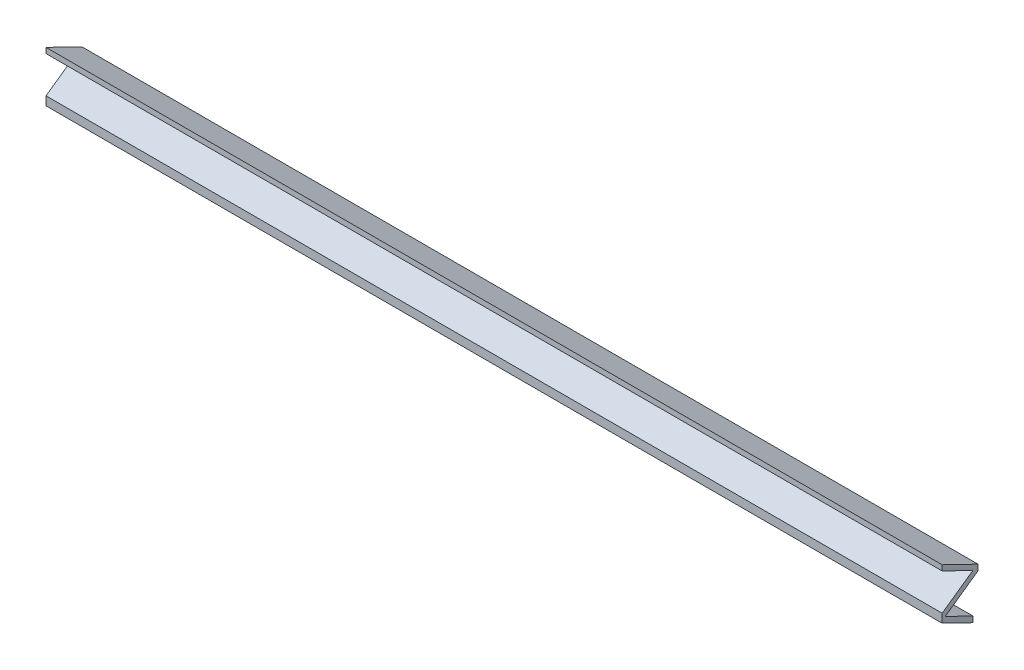
ISO-10303-21;
HEADER;
FILE_DESCRIPTION(('STEP AP214'),'2;1');
FILE_NAME('part.step','',(''),(''),'','','');
FILE_SCHEMA(('AUTOMOTIVE_DESIGN { 1 0 10303 214 1 1 1 1 }'));
ENDSEC;
DATA;
#1=APPLICATION_CONTEXT('core data for automotive mechanical design processes');
#2=APPLICATION_PROTOCOL_DEFINITION('international standard','automotive_design',2000,#1);
#3=PRODUCT_CONTEXT('',#1,'mechanical');
#4=PRODUCT('Part','Part','',(#3));
#5=PRODUCT_RELATED_PRODUCT_CATEGORY('part','',(#4));
#6=PRODUCT_DEFINITION_FORMATION('','',#4);
#7=PRODUCT_DEFINITION_CONTEXT('part definition',#1,'design');
#8=PRODUCT_DEFINITION('design','',#6,#7);
#9=PRODUCT_DEFINITION_SHAPE('','',#8);
#10=(LENGTH_UNIT() NAMED_UNIT(*) SI_UNIT(.MILLI.,.METRE.));
#11=(NAMED_UNIT(*) PLANE_ANGLE_UNIT() SI_UNIT($,.RADIAN.));
#12=(NAMED_UNIT(*) SI_UNIT($,.STERADIAN.) SOLID_ANGLE_UNIT());
#13=UNCERTAINTY_MEASURE_WITH_UNIT(LENGTH_MEASURE(1.E-05),#10,'distance_accuracy_value','');
#14=(GEOMETRIC_REPRESENTATION_CONTEXT(3) GLOBAL_UNCERTAINTY_ASSIGNED_CONTEXT((#13)) GLOBAL_UNIT_ASSIGNED_CONTEXT((#10,
#11,#12)) REPRESENTATION_CONTEXT('',''));
#15=CARTESIAN_POINT('',(0.,0.,0.));
#16=DIRECTION('',(0.,0.,1.));
#17=DIRECTION('',(1.,0.,0.));
#18=AXIS2_PLACEMENT_3D('',#15,#16,#17);
#19=CARTESIAN_POINT('',(500.,0.,0.));
#20=DIRECTION('',(0.,-0.899741930154531,0.436422340310163));
#21=DIRECTION('',(0.,-0.436422340310163,-0.899741930154531));
#22=AXIS2_PLACEMENT_3D('',#19,#20,#21);
#23=PLANE('',#22);
#24=DIRECTION('',(0.,0.436422340310163,0.899741930154531));
#25=VECTOR('',#24,1.);
#26=CARTESIAN_POINT('',(0.,0.,0.));
#27=LINE('',#26,#25);
#28=CARTESIAN_POINT('',(0.,-9.70105595134834,-20.));
#29=VERTEX_POINT('',#28);
#30=CARTESIAN_POINT('',(0.,0.,0.));
#31=VERTEX_POINT('',#30);
#32=EDGE_CURVE('E152',#29,#31,#27,.T.);
#33=ORIENTED_EDGE('',*,*,#32,.T.);
#34=DIRECTION('',(-1.,0.,0.));
#35=VECTOR('',#34,1.);
#36=CARTESIAN_POINT('',(500.,0.,0.));
#37=LINE('',#36,#35);
#38=CARTESIAN_POINT('',(500.,0.,0.));
#39=VERTEX_POINT('',#38);
#40=EDGE_CURVE('E11',#39,#31,#37,.T.);
#41=ORIENTED_EDGE('',*,*,#40,.F.);
#42=DIRECTION('',(0.,0.436422340310163,0.899741930154531));
#43=VECTOR('',#42,1.);
#44=CARTESIAN_POINT('',(500.,0.,0.));
#45=LINE('',#44,#43);
#46=CARTESIAN_POINT('',(500.,-9.70105595134834,-20.));
#47=VERTEX_POINT('',#46);
#48=EDGE_CURVE('E180',#47,#39,#45,.T.);
#49=ORIENTED_EDGE('',*,*,#48,.F.);
#50=DIRECTION('',(-1.,0.,0.));
#51=VECTOR('',#50,1.);
#52=CARTESIAN_POINT('',(500.,-9.70105595134834,-20.));
#53=LINE('',#52,#51);
#54=EDGE_CURVE('E148',#47,#29,#53,.T.);
#55=ORIENTED_EDGE('',*,*,#54,.T.);
#56=EDGE_LOOP('',(#33,#41,#49,#55));
#57=FACE_BOUND('',#56,.T.);
#58=ADVANCED_FACE('F39',(#57),#23,.F.);
#59=CARTESIAN_POINT('',(500.,0.,0.));
#60=DIRECTION('',(0.,0.,-1.));
#61=DIRECTION('',(0.,1.,0.));
#62=AXIS2_PLACEMENT_3D('',#59,#60,#61);
#63=PLANE('',#62);
#64=DIRECTION('',(0.,-1.,0.));
#65=VECTOR('',#64,1.);
#66=CARTESIAN_POINT('',(0.,0.,0.));
#67=LINE('',#66,#65);
#68=CARTESIAN_POINT('',(0.,-3.,0.));
#69=VERTEX_POINT('',#68);
#70=EDGE_CURVE('E156',#31,#69,#67,.T.);
#71=ORIENTED_EDGE('',*,*,#70,.T.);
#72=DIRECTION('',(-1.,0.,0.));
#73=VECTOR('',#72,1.);
#74=CARTESIAN_POINT('',(500.,-3.,0.));
#75=LINE('',#74,#73);
#76=CARTESIAN_POINT('',(500.,-3.,0.));
#77=VERTEX_POINT('',#76);
#78=EDGE_CURVE('E48',#77,#69,#75,.T.);
#79=ORIENTED_EDGE('',*,*,#78,.F.);
#80=DIRECTION('',(0.,-1.,0.));
#81=VECTOR('',#80,1.);
#82=CARTESIAN_POINT('',(500.,0.,0.));
#83=LINE('',#82,#81);
#84=EDGE_CURVE('E105',#39,#77,#83,.T.);
#85=ORIENTED_EDGE('',*,*,#84,.F.);
#86=ORIENTED_EDGE('',*,*,#40,.T.);
#87=EDGE_LOOP('',(#71,#79,#85,#86));
#88=FACE_BOUND('',#87,.T.);
#89=ADVANCED_FACE('F244',(#88),#63,.F.);
#90=CARTESIAN_POINT('',(500.,-3.,0.));
#91=DIRECTION('',(0.,0.899741930154531,-0.436422340310163));
#92=DIRECTION('',(0.,0.436422340310163,0.899741930154531));
#93=AXIS2_PLACEMENT_3D('',#90,#91,#92);
#94=PLANE('',#93);
#95=DIRECTION('',(0.,-0.436422340310163,-0.899741930154531));
#96=VECTOR('',#95,1.);
#97=CARTESIAN_POINT('',(0.,-3.,0.));
#98=LINE('',#97,#96);
#99=CARTESIAN_POINT('',(0.,-11.3187694157209,-17.1502348969851));
#100=VERTEX_POINT('',#99);
#101=EDGE_CURVE('E159',#69,#100,#98,.T.);
#102=ORIENTED_EDGE('',*,*,#101,.T.);
#103=DIRECTION('',(-1.,0.,0.));
#104=VECTOR('',#103,1.);
#105=CARTESIAN_POINT('',(500.,-11.3187694157209,-17.1502348969851));
#106=LINE('',#105,#104);
#107=CARTESIAN_POINT('',(500.,-11.3187694157209,-17.1502348969851));
#108=VERTEX_POINT('',#107);
#109=EDGE_CURVE('E199',#108,#100,#106,.T.);
#110=ORIENTED_EDGE('',*,*,#109,.F.);
#111=DIRECTION('',(0.,-0.436422340310163,-0.899741930154531));
#112=VECTOR('',#111,1.);
#113=CARTESIAN_POINT('',(500.,-3.,0.));
#114=LINE('',#113,#112);
#115=EDGE_CURVE('E209',#77,#108,#114,.T.);
#116=ORIENTED_EDGE('',*,*,#115,.F.);
#117=ORIENTED_EDGE('',*,*,#78,.T.);
#118=EDGE_LOOP('',(#102,#110,#116,#117));
#119=FACE_BOUND('',#118,.T.);
#120=ADVANCED_FACE('F207',(#119),#94,.F.);
#121=CARTESIAN_POINT('',(500.,-23.3976604087239,0.));
#122=DIRECTION('',(0.,-0.817577344114148,-0.575818796490056));
#123=DIRECTION('',(0.,0.575818796490056,-0.817577344114148));
#124=AXIS2_PLACEMENT_3D('',#121,#122,#123);
#125=PLANE('',#124);
#126=DIRECTION('',(0.,-0.575818796490056,0.817577344114148));
#127=VECTOR('',#126,1.);
#128=CARTESIAN_POINT('',(0.,-23.3976604087239,0.));
#129=LINE('',#128,#127);
#130=CARTESIAN_POINT('',(0.,-23.3976604087239,0.));
#131=VERTEX_POINT('',#130);
#132=EDGE_CURVE('E162',#100,#131,#129,.T.);
#133=ORIENTED_EDGE('',*,*,#132,.T.);
#134=DIRECTION('',(-1.,0.,0.));
#135=VECTOR('',#134,1.);
#136=CARTESIAN_POINT('',(500.,-23.3976604087239,0.));
#137=LINE('',#136,#135);
#138=CARTESIAN_POINT('',(500.,-23.3976604087239,0.));
#139=VERTEX_POINT('',#138);
#140=EDGE_CURVE('E195',#139,#131,#137,.T.);
#141=ORIENTED_EDGE('',*,*,#140,.F.);
#142=DIRECTION('',(0.,-0.575818796490056,0.817577344114148));
#143=VECTOR('',#142,1.);
#144=CARTESIAN_POINT('',(500.,-23.3976604087239,0.));
#145=LINE('',#144,#143);
#146=EDGE_CURVE('E228',#108,#139,#145,.T.);
#147=ORIENTED_EDGE('',*,*,#146,.F.);
#148=ORIENTED_EDGE('',*,*,#109,.T.);
#149=EDGE_LOOP('',(#133,#141,#147,#148));
#150=FACE_BOUND('',#149,.T.);
#151=ADVANCED_FACE('F218',(#150),#125,.F.);
#152=CARTESIAN_POINT('',(500.,-23.3976604087239,0.));
#153=DIRECTION('',(0.,0.,-1.));
#154=DIRECTION('',(-1.,0.,0.));
#155=AXIS2_PLACEMENT_3D('',#152,#153,#154);
#156=PLANE('',#155);
#157=DIRECTION('',(0.,-1.,0.));
#158=VECTOR('',#157,1.);
#159=CARTESIAN_POINT('',(0.,-23.3976604087239,0.));
#160=LINE('',#159,#158);
#161=CARTESIAN_POINT('',(0.,-28.2555464430726,0.));
#162=VERTEX_POINT('',#161);
#163=EDGE_CURVE('E165',#131,#162,#160,.T.);
#164=ORIENTED_EDGE('',*,*,#163,.T.);
#165=DIRECTION('',(-1.,0.,0.));
#166=VECTOR('',#165,1.);
#167=CARTESIAN_POINT('',(500.,-28.2555464430726,0.));
#168=LINE('',#167,#166);
#169=CARTESIAN_POINT('',(500.,-28.2555464430726,0.));
#170=VERTEX_POINT('',#169);
#171=EDGE_CURVE('E191',#170,#162,#168,.T.);
#172=ORIENTED_EDGE('',*,*,#171,.F.);
#173=DIRECTION('',(0.,-1.,0.));
#174=VECTOR('',#173,1.);
#175=CARTESIAN_POINT('',(500.,-23.3976604087239,0.));
#176=LINE('',#175,#174);
#177=EDGE_CURVE('E224',#139,#170,#176,.T.);
#178=ORIENTED_EDGE('',*,*,#177,.F.);
#179=ORIENTED_EDGE('',*,*,#140,.T.);
#180=EDGE_LOOP('',(#164,#172,#178,#179));
#181=FACE_BOUND('',#180,.T.);
#182=ADVANCED_FACE('F222',(#181),#156,.F.);
#183=CARTESIAN_POINT('',(500.,-36.5743158587936,-17.1502348969851));
#184=DIRECTION('',(0.,0.899741930154531,-0.436422340310163));
#185=DIRECTION('',(0.,0.436422340310163,0.899741930154531));
#186=AXIS2_PLACEMENT_3D('',#183,#184,#185);
#187=PLANE('',#186);
#188=DIRECTION('',(0.,-0.436422340310163,-0.899741930154531));
#189=VECTOR('',#188,1.);
#190=CARTESIAN_POINT('',(0.,-36.5743158587936,-17.1502348969851));
#191=LINE('',#190,#189);
#192=CARTESIAN_POINT('',(0.,-36.5743158587936,-17.1502348969851));
#193=VERTEX_POINT('',#192);
#194=EDGE_CURVE('E168',#162,#193,#191,.T.);
#195=ORIENTED_EDGE('',*,*,#194,.T.);
#196=DIRECTION('',(-1.,0.,0.));
#197=VECTOR('',#196,1.);
#198=CARTESIAN_POINT('',(500.,-36.5743158587936,-17.1502348969851));
#199=LINE('',#198,#197);
#200=CARTESIAN_POINT('',(500.,-36.5743158587936,-17.1502348969851));
#201=VERTEX_POINT('',#200);
#202=EDGE_CURVE('E187',#201,#193,#199,.T.);
#203=ORIENTED_EDGE('',*,*,#202,.F.);
#204=DIRECTION('',(0.,-0.436422340310163,-0.899741930154531));
#205=VECTOR('',#204,1.);
#206=CARTESIAN_POINT('',(500.,-36.5743158587936,-17.1502348969851));
#207=LINE('',#206,#205);
#208=EDGE_CURVE('E227',#170,#201,#207,.T.);
#209=ORIENTED_EDGE('',*,*,#208,.F.);
#210=ORIENTED_EDGE('',*,*,#171,.T.);
#211=EDGE_LOOP('',(#195,#203,#209,#210));
#212=FACE_BOUND('',#211,.T.);
#213=ADVANCED_FACE('F256',(#212),#187,.F.);
#214=CARTESIAN_POINT('',(500.,-33.3217825966434,-17.1502348969851));
#215=DIRECTION('',(0.,0.,1.));
#216=DIRECTION('',(1.,0.,0.));
#217=AXIS2_PLACEMENT_3D('',#214,#215,#216);
#218=PLANE('',#217);
#219=DIRECTION('',(0.,1.,0.));
#220=VECTOR('',#219,1.);
#221=CARTESIAN_POINT('',(0.,-33.3217825966434,-17.1502348969851));
#222=LINE('',#221,#220);
#223=CARTESIAN_POINT('',(0.,-33.3217825966434,-17.1502348969851));
#224=VERTEX_POINT('',#223);
#225=EDGE_CURVE('E171',#193,#224,#222,.T.);
#226=ORIENTED_EDGE('',*,*,#225,.T.);
#227=DIRECTION('',(-1.,0.,0.));
#228=VECTOR('',#227,1.);
#229=CARTESIAN_POINT('',(500.,-33.3217825966434,-17.1502348969851));
#230=LINE('',#229,#228);
#231=CARTESIAN_POINT('',(500.,-33.3217825966434,-17.1502348969851));
#232=VERTEX_POINT('',#231);
#233=EDGE_CURVE('E141',#232,#224,#230,.T.);
#234=ORIENTED_EDGE('',*,*,#233,.F.);
#235=DIRECTION('',(0.,1.,0.));
#236=VECTOR('',#235,1.);
#237=CARTESIAN_POINT('',(500.,-33.3217825966434,-17.1502348969851));
#238=LINE('',#237,#236);
#239=EDGE_CURVE('E130',#201,#232,#238,.T.);
#240=ORIENTED_EDGE('',*,*,#239,.F.);
#241=ORIENTED_EDGE('',*,*,#202,.T.);
#242=EDGE_LOOP('',(#226,#234,#240,#241));
#243=FACE_BOUND('',#242,.T.);
#244=ADVANCED_FACE('F259',(#243),#218,.F.);
#245=CARTESIAN_POINT('',(500.,-25.8266034258983,-1.69793937712792));
#246=DIRECTION('',(0.,-0.899741930154531,0.436422340310163));
#247=DIRECTION('',(0.,-0.436422340310163,-0.899741930154531));
#248=AXIS2_PLACEMENT_3D('',#245,#246,#247);
#249=PLANE('',#248);
#250=DIRECTION('',(0.,0.436422340310163,0.899741930154531));
#251=VECTOR('',#250,1.);
#252=CARTESIAN_POINT('',(0.,-25.8266034258983,-1.69793937712792));
#253=LINE('',#252,#251);
#254=CARTESIAN_POINT('',(0.,-25.8266034258983,-1.69793937712792));
#255=VERTEX_POINT('',#254);
#256=EDGE_CURVE('E139',#224,#255,#253,.T.);
#257=ORIENTED_EDGE('',*,*,#256,.T.);
#258=DIRECTION('',(-1.,0.,0.));
#259=VECTOR('',#258,1.);
#260=CARTESIAN_POINT('',(500.,-25.8266034258983,-1.69793937712792));
#261=LINE('',#260,#259);
#262=CARTESIAN_POINT('',(500.,-25.8266034258983,-1.69793937712792));
#263=VERTEX_POINT('',#262);
#264=EDGE_CURVE('E136',#263,#255,#261,.T.);
#265=ORIENTED_EDGE('',*,*,#264,.F.);
#266=DIRECTION('',(0.,0.436422340310163,0.899741930154531));
#267=VECTOR('',#266,1.);
#268=CARTESIAN_POINT('',(500.,-25.8266034258983,-1.69793937712792));
#269=LINE('',#268,#267);
#270=EDGE_CURVE('E124',#232,#263,#269,.T.);
#271=ORIENTED_EDGE('',*,*,#270,.F.);
#272=ORIENTED_EDGE('',*,*,#233,.T.);
#273=EDGE_LOOP('',(#257,#265,#271,#272));
#274=FACE_BOUND('',#273,.T.);
#275=ADVANCED_FACE('F137',(#274),#249,.F.);
#276=CARTESIAN_POINT('',(500.,-12.9364828800936,-20.));
#277=DIRECTION('',(0.,0.817577344114148,0.575818796490056));
#278=DIRECTION('',(0.,-0.575818796490056,0.817577344114148));
#279=AXIS2_PLACEMENT_3D('',#276,#277,#278);
#280=PLANE('',#279);
#281=DIRECTION('',(0.,0.575818796490055,-0.817577344114148));
#282=VECTOR('',#281,1.);
#283=CARTESIAN_POINT('',(0.,-12.9364828800936,-20.));
#284=LINE('',#283,#282);
#285=CARTESIAN_POINT('',(0.,-12.9364828800936,-20.));
#286=VERTEX_POINT('',#285);
#287=EDGE_CURVE('E91',#255,#286,#284,.T.);
#288=ORIENTED_EDGE('',*,*,#287,.T.);
#289=DIRECTION('',(-1.,0.,0.));
#290=VECTOR('',#289,1.);
#291=CARTESIAN_POINT('',(500.,-12.9364828800936,-20.));
#292=LINE('',#291,#290);
#293=CARTESIAN_POINT('',(500.,-12.9364828800936,-20.));
#294=VERTEX_POINT('',#293);
#295=EDGE_CURVE('E142',#294,#286,#292,.T.);
#296=ORIENTED_EDGE('',*,*,#295,.F.);
#297=DIRECTION('',(0.,0.575818796490055,-0.817577344114148));
#298=VECTOR('',#297,1.);
#299=CARTESIAN_POINT('',(500.,-12.9364828800936,-20.));
#300=LINE('',#299,#298);
#301=EDGE_CURVE('E128',#263,#294,#300,.T.);
#302=ORIENTED_EDGE('',*,*,#301,.F.);
#303=ORIENTED_EDGE('',*,*,#264,.T.);
#304=EDGE_LOOP('',(#288,#296,#302,#303));
#305=FACE_BOUND('',#304,.T.);
#306=ADVANCED_FACE('F144',(#305),#280,.F.);
#307=CARTESIAN_POINT('',(500.,-9.70105595134834,-20.));
#308=DIRECTION('',(0.,0.,1.));
#309=DIRECTION('',(1.,0.,0.));
#310=AXIS2_PLACEMENT_3D('',#307,#308,#309);
#311=PLANE('',#310);
#312=DIRECTION('',(0.,1.,0.));
#313=VECTOR('',#312,1.);
#314=CARTESIAN_POINT('',(0.,-9.70105595134834,-20.));
#315=LINE('',#314,#313);
#316=EDGE_CURVE('E97',#286,#29,#315,.T.);
#317=ORIENTED_EDGE('',*,*,#316,.T.);
#318=ORIENTED_EDGE('',*,*,#54,.F.);
#319=DIRECTION('',(0.,1.,0.));
#320=VECTOR('',#319,1.);
#321=CARTESIAN_POINT('',(500.,-9.70105595134834,-20.));
#322=LINE('',#321,#320);
#323=EDGE_CURVE('E56',#294,#47,#322,.T.);
#324=ORIENTED_EDGE('',*,*,#323,.F.);
#325=ORIENTED_EDGE('',*,*,#295,.T.);
#326=EDGE_LOOP('',(#317,#318,#324,#325));
#327=FACE_BOUND('',#326,.T.);
#328=ADVANCED_FACE('F268',(#327),#311,.F.);
#329=CARTESIAN_POINT('',(500.,0.,0.));
#330=DIRECTION('',(-1.,0.,0.));
#331=DIRECTION('',(0.,0.,1.));
#332=AXIS2_PLACEMENT_3D('',#329,#330,#331);
#333=PLANE('',#332);
#334=ORIENTED_EDGE('',*,*,#48,.T.);
#335=ORIENTED_EDGE('',*,*,#84,.T.);
#336=ORIENTED_EDGE('',*,*,#115,.T.);
#337=ORIENTED_EDGE('',*,*,#146,.T.);
#338=ORIENTED_EDGE('',*,*,#177,.T.);
#339=ORIENTED_EDGE('',*,*,#208,.T.);
#340=ORIENTED_EDGE('',*,*,#239,.T.);
#341=ORIENTED_EDGE('',*,*,#270,.T.);
#342=ORIENTED_EDGE('',*,*,#301,.T.);
#343=ORIENTED_EDGE('',*,*,#323,.T.);
#344=EDGE_LOOP('',(#334,#335,#336,#337,#338,#339,#340,#341,#342,#343));
#345=FACE_BOUND('',#344,.T.);
#346=ADVANCED_FACE('F126',(#345),#333,.F.);
#347=CARTESIAN_POINT('',(0.,0.,0.));
#348=DIRECTION('',(-1.,0.,0.));
#349=DIRECTION('',(0.,0.,1.));
#350=AXIS2_PLACEMENT_3D('',#347,#348,#349);
#351=PLANE('',#350);
#352=ORIENTED_EDGE('',*,*,#32,.F.);
#353=ORIENTED_EDGE('',*,*,#316,.F.);
#354=ORIENTED_EDGE('',*,*,#287,.F.);
#355=ORIENTED_EDGE('',*,*,#256,.F.);
#356=ORIENTED_EDGE('',*,*,#225,.F.);
#357=ORIENTED_EDGE('',*,*,#194,.F.);
#358=ORIENTED_EDGE('',*,*,#163,.F.);
#359=ORIENTED_EDGE('',*,*,#132,.F.);
#360=ORIENTED_EDGE('',*,*,#101,.F.);
#361=ORIENTED_EDGE('',*,*,#70,.F.);
#362=EDGE_LOOP('',(#352,#353,#354,#355,#356,#357,#358,#359,#360,#361));
#363=FACE_BOUND('',#362,.T.);
#364=ADVANCED_FACE('F213',(#363),#351,.T.);
#365=CLOSED_SHELL('',(#58,#89,#120,#151,#182,#213,#244,#275,#306,#328,#346,#364));
#366=MANIFOLD_SOLID_BREP('B2',#365);
#367=ADVANCED_BREP_SHAPE_REPRESENTATION('',(#18,#366),#14);
#368=SHAPE_DEFINITION_REPRESENTATION(#9,#367);
ENDSEC;
END-ISO-10303-21;
